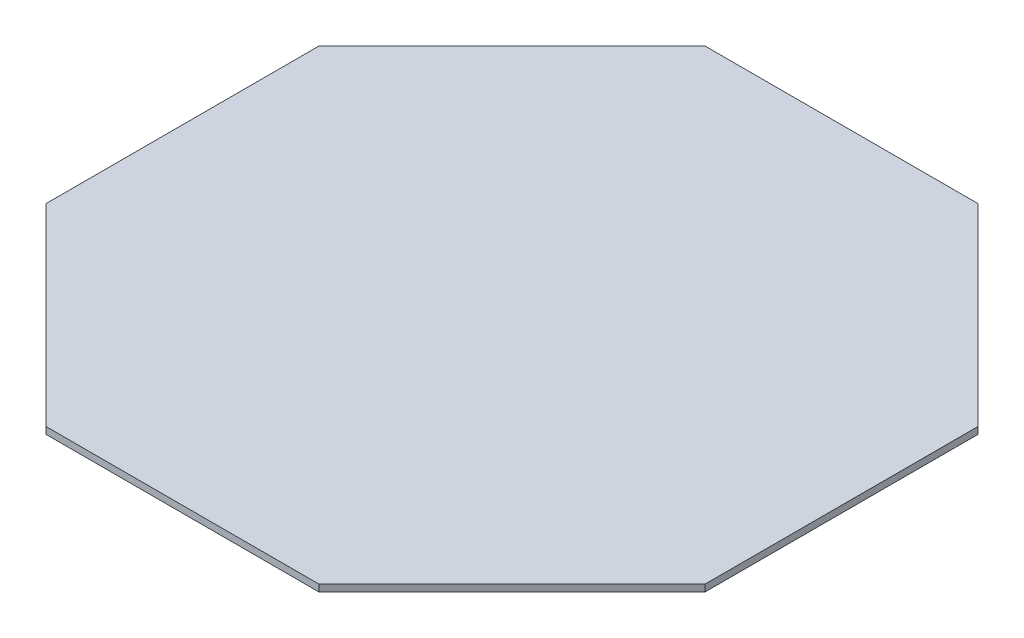
ISO-10303-21;
HEADER;
FILE_DESCRIPTION(('STEP AP214'),'2;1');
FILE_NAME('part.step','',(''),(''),'','','');
FILE_SCHEMA(('AUTOMOTIVE_DESIGN { 1 0 10303 214 1 1 1 1 }'));
ENDSEC;
DATA;
#1=APPLICATION_CONTEXT('core data for automotive mechanical design processes');
#2=APPLICATION_PROTOCOL_DEFINITION('international standard','automotive_design',2000,#1);
#3=PRODUCT_CONTEXT('',#1,'mechanical');
#4=PRODUCT('Part','Part','',(#3));
#5=PRODUCT_RELATED_PRODUCT_CATEGORY('part','',(#4));
#6=PRODUCT_DEFINITION_FORMATION('','',#4);
#7=PRODUCT_DEFINITION_CONTEXT('part definition',#1,'design');
#8=PRODUCT_DEFINITION('design','',#6,#7);
#9=PRODUCT_DEFINITION_SHAPE('','',#8);
#10=(LENGTH_UNIT() NAMED_UNIT(*) SI_UNIT(.MILLI.,.METRE.));
#11=(NAMED_UNIT(*) PLANE_ANGLE_UNIT() SI_UNIT($,.RADIAN.));
#12=(NAMED_UNIT(*) SI_UNIT($,.STERADIAN.) SOLID_ANGLE_UNIT());
#13=UNCERTAINTY_MEASURE_WITH_UNIT(LENGTH_MEASURE(1.E-05),#10,'distance_accuracy_value','');
#14=(GEOMETRIC_REPRESENTATION_CONTEXT(3) GLOBAL_UNCERTAINTY_ASSIGNED_CONTEXT((#13)) GLOBAL_UNIT_ASSIGNED_CONTEXT((#10,
#11,#12)) REPRESENTATION_CONTEXT('',''));
#15=CARTESIAN_POINT('',(0.,0.,0.));
#16=DIRECTION('',(0.,0.,1.));
#17=DIRECTION('',(1.,0.,0.));
#18=AXIS2_PLACEMENT_3D('',#15,#16,#17);
#19=CARTESIAN_POINT('',(144.852813742386,3.,60.));
#20=DIRECTION('',(-1.,0.,0.));
#21=DIRECTION('',(0.,0.,1.));
#22=AXIS2_PLACEMENT_3D('',#19,#20,#21);
#23=PLANE('',#22);
#24=DIRECTION('',(0.,0.,-1.));
#25=VECTOR('',#24,1.);
#26=CARTESIAN_POINT('',(144.852813742386,0.,60.));
#27=LINE('',#26,#25);
#28=CARTESIAN_POINT('',(144.852813742386,0.,60.));
#29=VERTEX_POINT('',#28);
#30=CARTESIAN_POINT('',(144.852813742386,0.,-60.));
#31=VERTEX_POINT('',#30);
#32=EDGE_CURVE('E127',#29,#31,#27,.T.);
#33=ORIENTED_EDGE('',*,*,#32,.T.);
#34=DIRECTION('',(0.,-1.,0.));
#35=VECTOR('',#34,1.);
#36=CARTESIAN_POINT('',(144.852813742386,3.,-60.));
#37=LINE('',#36,#35);
#38=CARTESIAN_POINT('',(144.852813742386,3.,-60.));
#39=VERTEX_POINT('',#38);
#40=EDGE_CURVE('E11',#39,#31,#37,.T.);
#41=ORIENTED_EDGE('',*,*,#40,.F.);
#42=DIRECTION('',(0.,0.,-1.));
#43=VECTOR('',#42,1.);
#44=CARTESIAN_POINT('',(144.852813742386,3.,60.));
#45=LINE('',#44,#43);
#46=CARTESIAN_POINT('',(144.852813742386,3.,60.));
#47=VERTEX_POINT('',#46);
#48=EDGE_CURVE('E141',#47,#39,#45,.T.);
#49=ORIENTED_EDGE('',*,*,#48,.F.);
#50=DIRECTION('',(0.,-1.,0.));
#51=VECTOR('',#50,1.);
#52=CARTESIAN_POINT('',(144.852813742386,3.,60.));
#53=LINE('',#52,#51);
#54=EDGE_CURVE('E123',#47,#29,#53,.T.);
#55=ORIENTED_EDGE('',*,*,#54,.T.);
#56=EDGE_LOOP('',(#33,#41,#49,#55));
#57=FACE_BOUND('',#56,.T.);
#58=ADVANCED_FACE('F31',(#57),#23,.F.);
#59=CARTESIAN_POINT('',(144.852813742386,3.,-60.));
#60=DIRECTION('',(-0.707106781186547,0.,0.707106781186547));
#61=DIRECTION('',(0.707106781186548,0.,0.707106781186548));
#62=AXIS2_PLACEMENT_3D('',#59,#60,#61);
#63=PLANE('',#62);
#64=DIRECTION('',(-0.707106781186548,0.,-0.707106781186548));
#65=VECTOR('',#64,1.);
#66=CARTESIAN_POINT('',(144.852813742386,0.,-60.));
#67=LINE('',#66,#65);
#68=CARTESIAN_POINT('',(60.,0.,-144.852813742386));
#69=VERTEX_POINT('',#68);
#70=EDGE_CURVE('E130',#31,#69,#67,.T.);
#71=ORIENTED_EDGE('',*,*,#70,.T.);
#72=DIRECTION('',(0.,-1.,0.));
#73=VECTOR('',#72,1.);
#74=CARTESIAN_POINT('',(60.,3.,-144.852813742386));
#75=LINE('',#74,#73);
#76=CARTESIAN_POINT('',(60.,3.,-144.852813742386));
#77=VERTEX_POINT('',#76);
#78=EDGE_CURVE('E39',#77,#69,#75,.T.);
#79=ORIENTED_EDGE('',*,*,#78,.F.);
#80=DIRECTION('',(-0.707106781186548,0.,-0.707106781186548));
#81=VECTOR('',#80,1.);
#82=CARTESIAN_POINT('',(144.852813742386,3.,-60.));
#83=LINE('',#82,#81);
#84=EDGE_CURVE('E90',#39,#77,#83,.T.);
#85=ORIENTED_EDGE('',*,*,#84,.F.);
#86=ORIENTED_EDGE('',*,*,#40,.T.);
#87=EDGE_LOOP('',(#71,#79,#85,#86));
#88=FACE_BOUND('',#87,.T.);
#89=ADVANCED_FACE('F176',(#88),#63,.F.);
#90=CARTESIAN_POINT('',(60.,3.,-144.852813742386));
#91=DIRECTION('',(0.,0.,1.));
#92=DIRECTION('',(1.,0.,0.));
#93=AXIS2_PLACEMENT_3D('',#90,#91,#92);
#94=PLANE('',#93);
#95=DIRECTION('',(-1.,0.,0.));
#96=VECTOR('',#95,1.);
#97=CARTESIAN_POINT('',(60.,0.,-144.852813742386));
#98=LINE('',#97,#96);
#99=CARTESIAN_POINT('',(-60.,0.,-144.852813742386));
#100=VERTEX_POINT('',#99);
#101=EDGE_CURVE('E132',#69,#100,#98,.T.);
#102=ORIENTED_EDGE('',*,*,#101,.T.);
#103=DIRECTION('',(0.,-1.,0.));
#104=VECTOR('',#103,1.);
#105=CARTESIAN_POINT('',(-60.,3.,-144.852813742386));
#106=LINE('',#105,#104);
#107=CARTESIAN_POINT('',(-60.,3.,-144.852813742386));
#108=VERTEX_POINT('',#107);
#109=EDGE_CURVE('E148',#108,#100,#106,.T.);
#110=ORIENTED_EDGE('',*,*,#109,.F.);
#111=DIRECTION('',(-1.,0.,0.));
#112=VECTOR('',#111,1.);
#113=CARTESIAN_POINT('',(60.,3.,-144.852813742386));
#114=LINE('',#113,#112);
#115=EDGE_CURVE('E156',#77,#108,#114,.T.);
#116=ORIENTED_EDGE('',*,*,#115,.F.);
#117=ORIENTED_EDGE('',*,*,#78,.T.);
#118=EDGE_LOOP('',(#102,#110,#116,#117));
#119=FACE_BOUND('',#118,.T.);
#120=ADVANCED_FACE('F154',(#119),#94,.F.);
#121=CARTESIAN_POINT('',(-60.,3.,-144.852813742386));
#122=DIRECTION('',(0.707106781186547,0.,0.707106781186548));
#123=DIRECTION('',(0.707106781186548,0.,-0.707106781186547));
#124=AXIS2_PLACEMENT_3D('',#121,#122,#123);
#125=PLANE('',#124);
#126=DIRECTION('',(-0.707106781186548,0.,0.707106781186547));
#127=VECTOR('',#126,1.);
#128=CARTESIAN_POINT('',(-60.,0.,-144.852813742386));
#129=LINE('',#128,#127);
#130=CARTESIAN_POINT('',(-144.852813742386,0.,-60.));
#131=VERTEX_POINT('',#130);
#132=EDGE_CURVE('E134',#100,#131,#129,.T.);
#133=ORIENTED_EDGE('',*,*,#132,.T.);
#134=DIRECTION('',(0.,-1.,0.));
#135=VECTOR('',#134,1.);
#136=CARTESIAN_POINT('',(-144.852813742386,3.,-60.));
#137=LINE('',#136,#135);
#138=CARTESIAN_POINT('',(-144.852813742386,3.,-60.));
#139=VERTEX_POINT('',#138);
#140=EDGE_CURVE('E145',#139,#131,#137,.T.);
#141=ORIENTED_EDGE('',*,*,#140,.F.);
#142=DIRECTION('',(-0.707106781186548,0.,0.707106781186547));
#143=VECTOR('',#142,1.);
#144=CARTESIAN_POINT('',(-60.,3.,-144.852813742386));
#145=LINE('',#144,#143);
#146=EDGE_CURVE('E168',#108,#139,#145,.T.);
#147=ORIENTED_EDGE('',*,*,#146,.F.);
#148=ORIENTED_EDGE('',*,*,#109,.T.);
#149=EDGE_LOOP('',(#133,#141,#147,#148));
#150=FACE_BOUND('',#149,.T.);
#151=ADVANCED_FACE('F164',(#150),#125,.F.);
#152=CARTESIAN_POINT('',(-144.852813742386,3.,-60.));
#153=DIRECTION('',(1.,0.,0.));
#154=DIRECTION('',(0.,0.,-1.));
#155=AXIS2_PLACEMENT_3D('',#152,#153,#154);
#156=PLANE('',#155);
#157=DIRECTION('',(0.,0.,1.));
#158=VECTOR('',#157,1.);
#159=CARTESIAN_POINT('',(-144.852813742386,0.,-60.));
#160=LINE('',#159,#158);
#161=CARTESIAN_POINT('',(-144.852813742386,0.,60.));
#162=VERTEX_POINT('',#161);
#163=EDGE_CURVE('E136',#131,#162,#160,.T.);
#164=ORIENTED_EDGE('',*,*,#163,.T.);
#165=DIRECTION('',(0.,-1.,0.));
#166=VECTOR('',#165,1.);
#167=CARTESIAN_POINT('',(-144.852813742386,3.,60.));
#168=LINE('',#167,#166);
#169=CARTESIAN_POINT('',(-144.852813742386,3.,60.));
#170=VERTEX_POINT('',#169);
#171=EDGE_CURVE('E118',#170,#162,#168,.T.);
#172=ORIENTED_EDGE('',*,*,#171,.F.);
#173=DIRECTION('',(0.,0.,1.));
#174=VECTOR('',#173,1.);
#175=CARTESIAN_POINT('',(-144.852813742386,3.,-60.));
#176=LINE('',#175,#174);
#177=EDGE_CURVE('E109',#139,#170,#176,.T.);
#178=ORIENTED_EDGE('',*,*,#177,.F.);
#179=ORIENTED_EDGE('',*,*,#140,.T.);
#180=EDGE_LOOP('',(#164,#172,#178,#179));
#181=FACE_BOUND('',#180,.T.);
#182=ADVANCED_FACE('F167',(#181),#156,.F.);
#183=CARTESIAN_POINT('',(-144.852813742386,3.,60.));
#184=DIRECTION('',(0.707106781186547,0.,-0.707106781186547));
#185=DIRECTION('',(-0.707106781186548,0.,-0.707106781186548));
#186=AXIS2_PLACEMENT_3D('',#183,#184,#185);
#187=PLANE('',#186);
#188=DIRECTION('',(0.707106781186548,0.,0.707106781186548));
#189=VECTOR('',#188,1.);
#190=CARTESIAN_POINT('',(-144.852813742386,0.,60.));
#191=LINE('',#190,#189);
#192=CARTESIAN_POINT('',(-60.,0.,144.852813742386));
#193=VERTEX_POINT('',#192);
#194=EDGE_CURVE('E117',#162,#193,#191,.T.);
#195=ORIENTED_EDGE('',*,*,#194,.T.);
#196=DIRECTION('',(0.,-1.,0.));
#197=VECTOR('',#196,1.);
#198=CARTESIAN_POINT('',(-60.,3.,144.852813742386));
#199=LINE('',#198,#197);
#200=CARTESIAN_POINT('',(-60.,3.,144.852813742386));
#201=VERTEX_POINT('',#200);
#202=EDGE_CURVE('E114',#201,#193,#199,.T.);
#203=ORIENTED_EDGE('',*,*,#202,.F.);
#204=DIRECTION('',(0.707106781186548,0.,0.707106781186548));
#205=VECTOR('',#204,1.);
#206=CARTESIAN_POINT('',(-144.852813742386,3.,60.));
#207=LINE('',#206,#205);
#208=EDGE_CURVE('E103',#170,#201,#207,.T.);
#209=ORIENTED_EDGE('',*,*,#208,.F.);
#210=ORIENTED_EDGE('',*,*,#171,.T.);
#211=EDGE_LOOP('',(#195,#203,#209,#210));
#212=FACE_BOUND('',#211,.T.);
#213=ADVANCED_FACE('F115',(#212),#187,.F.);
#214=CARTESIAN_POINT('',(-60.,3.,144.852813742386));
#215=DIRECTION('',(0.,0.,-1.));
#216=DIRECTION('',(-1.,0.,0.));
#217=AXIS2_PLACEMENT_3D('',#214,#215,#216);
#218=PLANE('',#217);
#219=DIRECTION('',(1.,0.,0.));
#220=VECTOR('',#219,1.);
#221=CARTESIAN_POINT('',(-60.,0.,144.852813742386));
#222=LINE('',#221,#220);
#223=CARTESIAN_POINT('',(60.,0.,144.852813742386));
#224=VERTEX_POINT('',#223);
#225=EDGE_CURVE('E76',#193,#224,#222,.T.);
#226=ORIENTED_EDGE('',*,*,#225,.T.);
#227=DIRECTION('',(0.,-1.,0.));
#228=VECTOR('',#227,1.);
#229=CARTESIAN_POINT('',(60.,3.,144.852813742386));
#230=LINE('',#229,#228);
#231=CARTESIAN_POINT('',(60.,3.,144.852813742386));
#232=VERTEX_POINT('',#231);
#233=EDGE_CURVE('E119',#232,#224,#230,.T.);
#234=ORIENTED_EDGE('',*,*,#233,.F.);
#235=DIRECTION('',(1.,0.,0.));
#236=VECTOR('',#235,1.);
#237=CARTESIAN_POINT('',(-60.,3.,144.852813742386));
#238=LINE('',#237,#236);
#239=EDGE_CURVE('E107',#201,#232,#238,.T.);
#240=ORIENTED_EDGE('',*,*,#239,.F.);
#241=ORIENTED_EDGE('',*,*,#202,.T.);
#242=EDGE_LOOP('',(#226,#234,#240,#241));
#243=FACE_BOUND('',#242,.T.);
#244=ADVANCED_FACE('F121',(#243),#218,.F.);
#245=CARTESIAN_POINT('',(60.,3.,144.852813742386));
#246=DIRECTION('',(-0.707106781186548,0.,-0.707106781186547));
#247=DIRECTION('',(-0.707106781186547,0.,0.707106781186548));
#248=AXIS2_PLACEMENT_3D('',#245,#246,#247);
#249=PLANE('',#248);
#250=DIRECTION('',(0.707106781186547,0.,-0.707106781186548));
#251=VECTOR('',#250,1.);
#252=CARTESIAN_POINT('',(60.,0.,144.852813742386));
#253=LINE('',#252,#251);
#254=EDGE_CURVE('E82',#224,#29,#253,.T.);
#255=ORIENTED_EDGE('',*,*,#254,.T.);
#256=ORIENTED_EDGE('',*,*,#54,.F.);
#257=DIRECTION('',(0.707106781186547,0.,-0.707106781186548));
#258=VECTOR('',#257,1.);
#259=CARTESIAN_POINT('',(60.,3.,144.852813742386));
#260=LINE('',#259,#258);
#261=EDGE_CURVE('E47',#232,#47,#260,.T.);
#262=ORIENTED_EDGE('',*,*,#261,.F.);
#263=ORIENTED_EDGE('',*,*,#233,.T.);
#264=EDGE_LOOP('',(#255,#256,#262,#263));
#265=FACE_BOUND('',#264,.T.);
#266=ADVANCED_FACE('F192',(#265),#249,.F.);
#267=CARTESIAN_POINT('',(144.852813742386,3.,-144.852813742386));
#268=DIRECTION('',(0.,1.,0.));
#269=DIRECTION('',(0.,0.,1.));
#270=AXIS2_PLACEMENT_3D('',#267,#268,#269);
#271=PLANE('',#270);
#272=ORIENTED_EDGE('',*,*,#48,.T.);
#273=ORIENTED_EDGE('',*,*,#84,.T.);
#274=ORIENTED_EDGE('',*,*,#115,.T.);
#275=ORIENTED_EDGE('',*,*,#146,.T.);
#276=ORIENTED_EDGE('',*,*,#177,.T.);
#277=ORIENTED_EDGE('',*,*,#208,.T.);
#278=ORIENTED_EDGE('',*,*,#239,.T.);
#279=ORIENTED_EDGE('',*,*,#261,.T.);
#280=EDGE_LOOP('',(#272,#273,#274,#275,#276,#277,#278,#279));
#281=FACE_BOUND('',#280,.T.);
#282=ADVANCED_FACE('F105',(#281),#271,.T.);
#283=CARTESIAN_POINT('',(144.852813742386,0.,-144.852813742386));
#284=DIRECTION('',(0.,1.,0.));
#285=DIRECTION('',(0.,0.,1.));
#286=AXIS2_PLACEMENT_3D('',#283,#284,#285);
#287=PLANE('',#286);
#288=ORIENTED_EDGE('',*,*,#32,.F.);
#289=ORIENTED_EDGE('',*,*,#254,.F.);
#290=ORIENTED_EDGE('',*,*,#225,.F.);
#291=ORIENTED_EDGE('',*,*,#194,.F.);
#292=ORIENTED_EDGE('',*,*,#163,.F.);
#293=ORIENTED_EDGE('',*,*,#132,.F.);
#294=ORIENTED_EDGE('',*,*,#101,.F.);
#295=ORIENTED_EDGE('',*,*,#70,.F.);
#296=EDGE_LOOP('',(#288,#289,#290,#291,#292,#293,#294,#295));
#297=FACE_BOUND('',#296,.T.);
#298=ADVANCED_FACE('F160',(#297),#287,.F.);
#299=CLOSED_SHELL('',(#58,#89,#120,#151,#182,#213,#244,#266,#282,#298));
#300=MANIFOLD_SOLID_BREP('B2',#299);
#301=ADVANCED_BREP_SHAPE_REPRESENTATION('',(#18,#300),#14);
#302=SHAPE_DEFINITION_REPRESENTATION(#9,#301);
ENDSEC;
END-ISO-10303-21;
